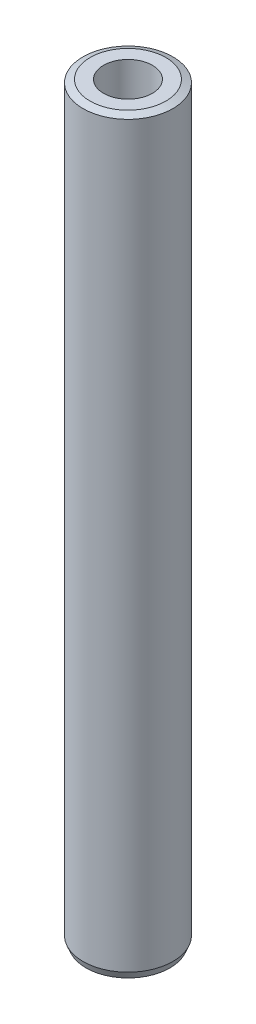
ISO-10303-21;
HEADER;
FILE_DESCRIPTION(('STEP AP214'),'2;1');
FILE_NAME('part.step','',(''),(''),'','','');
FILE_SCHEMA(('AUTOMOTIVE_DESIGN { 1 0 10303 214 1 1 1 1 }'));
ENDSEC;
DATA;
#1=APPLICATION_CONTEXT('core data for automotive mechanical design processes');
#2=APPLICATION_PROTOCOL_DEFINITION('international standard','automotive_design',2000,#1);
#3=PRODUCT_CONTEXT('',#1,'mechanical');
#4=PRODUCT('Part','Part','',(#3));
#5=PRODUCT_RELATED_PRODUCT_CATEGORY('part','',(#4));
#6=PRODUCT_DEFINITION_FORMATION('','',#4);
#7=PRODUCT_DEFINITION_CONTEXT('part definition',#1,'design');
#8=PRODUCT_DEFINITION('design','',#6,#7);
#9=PRODUCT_DEFINITION_SHAPE('','',#8);
#10=(LENGTH_UNIT() NAMED_UNIT(*) SI_UNIT(.MILLI.,.METRE.));
#11=(NAMED_UNIT(*) PLANE_ANGLE_UNIT() SI_UNIT($,.RADIAN.));
#12=(NAMED_UNIT(*) SI_UNIT($,.STERADIAN.) SOLID_ANGLE_UNIT());
#13=UNCERTAINTY_MEASURE_WITH_UNIT(LENGTH_MEASURE(1.E-05),#10,'distance_accuracy_value','');
#14=(GEOMETRIC_REPRESENTATION_CONTEXT(3) GLOBAL_UNCERTAINTY_ASSIGNED_CONTEXT((#13)) GLOBAL_UNIT_ASSIGNED_CONTEXT((#10,
#11,#12)) REPRESENTATION_CONTEXT('',''));
#15=CARTESIAN_POINT('',(0.,0.,0.));
#16=DIRECTION('',(0.,0.,1.));
#17=DIRECTION('',(1.,0.,0.));
#18=AXIS2_PLACEMENT_3D('',#15,#16,#17);
#19=CARTESIAN_POINT('',(0.,541.540851417953,0.));
#20=DIRECTION('',(0.,-1.,0.));
#21=DIRECTION('',(0.,0.,-1.));
#22=AXIS2_PLACEMENT_3D('',#19,#20,#21);
#23=CYLINDRICAL_SURFACE('',#22,32.5);
#24=CARTESIAN_POINT('',(0.,539.425409265146,0.));
#25=DIRECTION('',(0.,1.,0.));
#26=DIRECTION('',(0.,0.,1.));
#27=AXIS2_PLACEMENT_3D('',#24,#25,#26);
#28=CIRCLE('',#27,32.5);
#29=CARTESIAN_POINT('',(0.,539.425409265146,32.5));
#30=VERTEX_POINT('',#29);
#31=EDGE_CURVE('E50',#30,#30,#28,.F.);
#32=ORIENTED_EDGE('',*,*,#31,.T.);
#33=EDGE_LOOP('',(#32));
#34=FACE_BOUND('',#33,.T.);
#35=CARTESIAN_POINT('',(0.,5.1279255855714,0.));
#36=DIRECTION('',(0.,1.,0.));
#37=DIRECTION('',(0.,0.,1.));
#38=AXIS2_PLACEMENT_3D('',#35,#36,#37);
#39=CIRCLE('',#38,32.5);
#40=CARTESIAN_POINT('',(0.,5.1279255855714,32.5));
#41=VERTEX_POINT('',#40);
#42=EDGE_CURVE('E51',#41,#41,#39,.T.);
#43=ORIENTED_EDGE('',*,*,#42,.T.);
#44=EDGE_LOOP('',(#43));
#45=FACE_BOUND('',#44,.T.);
#46=ADVANCED_FACE('F39',(#34,#45),#23,.T.);
#47=CARTESIAN_POINT('',(0.,541.540851417953,0.));
#48=DIRECTION('',(0.,1.,0.));
#49=DIRECTION('',(0.,0.,1.));
#50=AXIS2_PLACEMENT_3D('',#47,#48,#49);
#51=PLANE('',#50);
#52=CARTESIAN_POINT('',(0.,541.540851417953,0.));
#53=DIRECTION('',(0.,1.,0.));
#54=DIRECTION('',(0.,0.,1.));
#55=AXIS2_PLACEMENT_3D('',#52,#53,#54);
#56=CIRCLE('',#55,27.372074414429);
#57=CARTESIAN_POINT('',(0.,541.540851417953,27.372074414429));
#58=VERTEX_POINT('',#57);
#59=EDGE_CURVE('E54',#58,#58,#56,.T.);
#60=ORIENTED_EDGE('',*,*,#59,.T.);
#61=EDGE_LOOP('',(#60));
#62=FACE_BOUND('',#61,.T.);
#63=CARTESIAN_POINT('',(0.,541.540851417953,0.));
#64=DIRECTION('',(0.,1.,0.));
#65=DIRECTION('',(0.,0.,1.));
#66=AXIS2_PLACEMENT_3D('',#63,#64,#65);
#67=CIRCLE('',#66,17.6354257498228);
#68=CARTESIAN_POINT('',(0.,541.540851417953,17.6354257498228));
#69=VERTEX_POINT('',#68);
#70=EDGE_CURVE('E58',#69,#69,#67,.T.);
#71=ORIENTED_EDGE('',*,*,#70,.F.);
#72=EDGE_LOOP('',(#71));
#73=FACE_BOUND('',#72,.T.);
#74=ADVANCED_FACE('F69',(#62,#73),#51,.T.);
#75=CARTESIAN_POINT('',(0.,0.,0.));
#76=DIRECTION('',(0.,1.,0.));
#77=DIRECTION('',(0.,0.,1.));
#78=AXIS2_PLACEMENT_3D('',#75,#76,#77);
#79=PLANE('',#78);
#80=CARTESIAN_POINT('',(0.,0.,0.));
#81=DIRECTION('',(0.,1.,0.));
#82=DIRECTION('',(0.,0.,1.));
#83=AXIS2_PLACEMENT_3D('',#80,#81,#82);
#84=CIRCLE('',#83,30.384557847192);
#85=CARTESIAN_POINT('',(0.,0.,30.384557847192));
#86=VERTEX_POINT('',#85);
#87=EDGE_CURVE('E10',#86,#86,#84,.F.);
#88=ORIENTED_EDGE('',*,*,#87,.T.);
#89=EDGE_LOOP('',(#88));
#90=FACE_BOUND('',#89,.T.);
#91=CARTESIAN_POINT('',(0.,0.,0.));
#92=DIRECTION('',(0.,1.,0.));
#93=DIRECTION('',(0.,0.,1.));
#94=AXIS2_PLACEMENT_3D('',#91,#92,#93);
#95=CIRCLE('',#94,17.6354257498228);
#96=CARTESIAN_POINT('',(0.,0.,17.6354257498228));
#97=VERTEX_POINT('',#96);
#98=EDGE_CURVE('E63',#97,#97,#95,.T.);
#99=ORIENTED_EDGE('',*,*,#98,.T.);
#100=EDGE_LOOP('',(#99));
#101=FACE_BOUND('',#100,.T.);
#102=ADVANCED_FACE('F75',(#90,#101),#79,.F.);
#103=CARTESIAN_POINT('',(0.,541.540851417953,0.));
#104=DIRECTION('',(0.,-1.,0.));
#105=DIRECTION('',(0.,0.,-1.));
#106=AXIS2_PLACEMENT_3D('',#103,#104,#105);
#107=CYLINDRICAL_SURFACE('',#106,17.6354257498228);
#108=ORIENTED_EDGE('',*,*,#70,.T.);
#109=EDGE_LOOP('',(#108));
#110=FACE_BOUND('',#109,.T.);
#111=ORIENTED_EDGE('',*,*,#98,.F.);
#112=EDGE_LOOP('',(#111));
#113=FACE_BOUND('',#112,.T.);
#114=ADVANCED_FACE('F70',(#110,#113),#107,.F.);
#115=CARTESIAN_POINT('',(0.,541.540851417953,0.));
#116=DIRECTION('',(0.,-1.,0.));
#117=DIRECTION('',(0.,0.,-1.));
#118=AXIS2_PLACEMENT_3D('',#115,#116,#117);
#119=CONICAL_SURFACE('',#118,27.372074414429,1.17953194215988);
#120=ORIENTED_EDGE('',*,*,#31,.F.);
#121=EDGE_LOOP('',(#120));
#122=FACE_BOUND('',#121,.T.);
#123=ORIENTED_EDGE('',*,*,#59,.F.);
#124=EDGE_LOOP('',(#123));
#125=FACE_BOUND('',#124,.T.);
#126=ADVANCED_FACE('F81',(#122,#125),#119,.T.);
#127=CARTESIAN_POINT('',(0.,5.1279255855714,0.));
#128=DIRECTION('',(0.,1.,0.));
#129=DIRECTION('',(0.,0.,1.));
#130=AXIS2_PLACEMENT_3D('',#127,#128,#129);
#131=CONICAL_SURFACE('',#130,32.5,0.391264384635018);
#132=ORIENTED_EDGE('',*,*,#87,.F.);
#133=EDGE_LOOP('',(#132));
#134=FACE_BOUND('',#133,.T.);
#135=ORIENTED_EDGE('',*,*,#42,.F.);
#136=EDGE_LOOP('',(#135));
#137=FACE_BOUND('',#136,.T.);
#138=ADVANCED_FACE('F45',(#134,#137),#131,.T.);
#139=CLOSED_SHELL('',(#46,#74,#102,#114,#126,#138));
#140=MANIFOLD_SOLID_BREP('B2',#139);
#141=ADVANCED_BREP_SHAPE_REPRESENTATION('',(#18,#140),#14);
#142=SHAPE_DEFINITION_REPRESENTATION(#9,#141);
ENDSEC;
END-ISO-10303-21;
